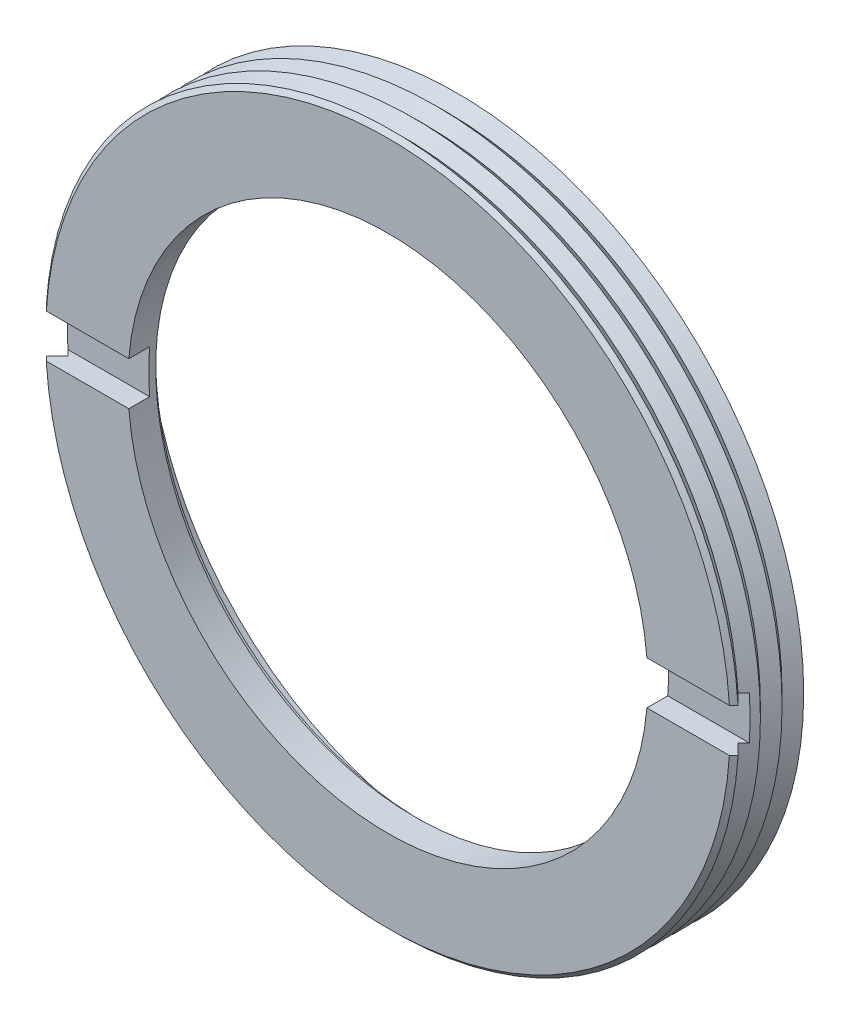
ISO-10303-21;
HEADER;
FILE_DESCRIPTION(('STEP AP214'),'2;1');
FILE_NAME('part.step','',(''),(''),'','','');
FILE_SCHEMA(('AUTOMOTIVE_DESIGN { 1 0 10303 214 1 1 1 1 }'));
ENDSEC;
DATA;
#1=APPLICATION_CONTEXT('core data for automotive mechanical design processes');
#2=APPLICATION_PROTOCOL_DEFINITION('international standard','automotive_design',2000,#1);
#3=PRODUCT_CONTEXT('',#1,'mechanical');
#4=PRODUCT('Part','Part','',(#3));
#5=PRODUCT_RELATED_PRODUCT_CATEGORY('part','',(#4));
#6=PRODUCT_DEFINITION_FORMATION('','',#4);
#7=PRODUCT_DEFINITION_CONTEXT('part definition',#1,'design');
#8=PRODUCT_DEFINITION('design','',#6,#7);
#9=PRODUCT_DEFINITION_SHAPE('','',#8);
#10=(LENGTH_UNIT() NAMED_UNIT(*) SI_UNIT(.MILLI.,.METRE.));
#11=(NAMED_UNIT(*) PLANE_ANGLE_UNIT() SI_UNIT($,.RADIAN.));
#12=(NAMED_UNIT(*) SI_UNIT($,.STERADIAN.) SOLID_ANGLE_UNIT());
#13=UNCERTAINTY_MEASURE_WITH_UNIT(LENGTH_MEASURE(1.E-05),#10,'distance_accuracy_value','');
#14=(GEOMETRIC_REPRESENTATION_CONTEXT(3) GLOBAL_UNCERTAINTY_ASSIGNED_CONTEXT((#13)) GLOBAL_UNIT_ASSIGNED_CONTEXT((#10,
#11,#12)) REPRESENTATION_CONTEXT('',''));
#15=CARTESIAN_POINT('',(0.,0.,0.));
#16=DIRECTION('',(0.,0.,1.));
#17=DIRECTION('',(1.,0.,0.));
#18=AXIS2_PLACEMENT_3D('',#15,#16,#17);
#19=CARTESIAN_POINT('',(0.,0.,1.778));
#20=DIRECTION('',(0.,0.,1.));
#21=DIRECTION('',(0.,-1.,0.));
#22=AXIS2_PLACEMENT_3D('',#19,#20,#21);
#23=PLANE('',#22);
#24=DIRECTION('',(1.,0.,0.));
#25=VECTOR('',#24,1.);
#26=CARTESIAN_POINT('',(-12.6751710417453,-0.793749999999999,1.778));
#27=LINE('',#26,#25);
#28=CARTESIAN_POINT('',(-12.4842921780732,-0.793749999999999,1.778));
#29=VERTEX_POINT('',#28);
#30=CARTESIAN_POINT('',(-9.49186946483673,-0.793749999999999,1.778));
#31=VERTEX_POINT('',#30);
#32=EDGE_CURVE('E131',#29,#31,#27,.T.);
#33=ORIENTED_EDGE('',*,*,#32,.T.);
#34=CARTESIAN_POINT('',(0.,0.,1.778));
#35=DIRECTION('',(0.,0.,1.));
#36=DIRECTION('',(1.,0.,0.));
#37=AXIS2_PLACEMENT_3D('',#34,#35,#36);
#38=CIRCLE('',#37,9.525);
#39=CARTESIAN_POINT('',(-9.49186946483673,0.793749999999999,1.778));
#40=VERTEX_POINT('',#39);
#41=EDGE_CURVE('E114',#31,#40,#38,.F.);
#42=ORIENTED_EDGE('',*,*,#41,.T.);
#43=DIRECTION('',(1.,0.,0.));
#44=VECTOR('',#43,1.);
#45=CARTESIAN_POINT('',(-12.6751710417454,0.793749999999999,1.778));
#46=LINE('',#45,#44);
#47=CARTESIAN_POINT('',(-12.4842921780732,0.793749999999999,1.778));
#48=VERTEX_POINT('',#47);
#49=EDGE_CURVE('E118',#40,#48,#46,.F.);
#50=ORIENTED_EDGE('',*,*,#49,.T.);
#51=CARTESIAN_POINT('',(0.,0.,1.778));
#52=DIRECTION('',(0.,0.,-1.));
#53=DIRECTION('',(-1.,0.,0.));
#54=AXIS2_PLACEMENT_3D('',#51,#52,#53);
#55=CIRCLE('',#54,12.5095);
#56=EDGE_CURVE('E20',#48,#29,#55,.F.);
#57=ORIENTED_EDGE('',*,*,#56,.T.);
#58=EDGE_LOOP('',(#33,#42,#50,#57));
#59=FACE_BOUND('',#58,.T.);
#60=ADVANCED_FACE('F17',(#59),#23,.T.);
#61=CARTESIAN_POINT('',(0.,0.,1.778));
#62=DIRECTION('',(0.,0.,1.));
#63=DIRECTION('',(0.,-1.,0.));
#64=AXIS2_PLACEMENT_3D('',#61,#62,#63);
#65=PLANE('',#64);
#66=DIRECTION('',(1.,0.,0.));
#67=VECTOR('',#66,1.);
#68=CARTESIAN_POINT('',(9.49186946483673,0.79375,1.778));
#69=LINE('',#68,#67);
#70=CARTESIAN_POINT('',(12.4842921780732,0.79375,1.778));
#71=VERTEX_POINT('',#70);
#72=CARTESIAN_POINT('',(9.49186946483673,0.79375,1.778));
#73=VERTEX_POINT('',#72);
#74=EDGE_CURVE('E133',#71,#73,#69,.F.);
#75=ORIENTED_EDGE('',*,*,#74,.T.);
#76=CARTESIAN_POINT('',(0.,0.,1.778));
#77=DIRECTION('',(0.,0.,1.));
#78=DIRECTION('',(1.,0.,0.));
#79=AXIS2_PLACEMENT_3D('',#76,#77,#78);
#80=CIRCLE('',#79,9.525);
#81=CARTESIAN_POINT('',(9.49186946483673,-0.793750000000005,1.778));
#82=VERTEX_POINT('',#81);
#83=EDGE_CURVE('E585',#73,#82,#80,.F.);
#84=ORIENTED_EDGE('',*,*,#83,.T.);
#85=DIRECTION('',(1.,0.,0.));
#86=VECTOR('',#85,1.);
#87=CARTESIAN_POINT('',(9.49186946483673,-0.793750000000005,1.778));
#88=LINE('',#87,#86);
#89=CARTESIAN_POINT('',(12.4842921780732,-0.793750000000005,1.778));
#90=VERTEX_POINT('',#89);
#91=EDGE_CURVE('E267',#82,#90,#88,.T.);
#92=ORIENTED_EDGE('',*,*,#91,.T.);
#93=CARTESIAN_POINT('',(0.,0.,1.778));
#94=DIRECTION('',(0.,0.,-1.));
#95=DIRECTION('',(-1.,0.,0.));
#96=AXIS2_PLACEMENT_3D('',#93,#94,#95);
#97=CIRCLE('',#96,12.5095);
#98=EDGE_CURVE('E586',#90,#71,#97,.F.);
#99=ORIENTED_EDGE('',*,*,#98,.T.);
#100=EDGE_LOOP('',(#75,#84,#92,#99));
#101=FACE_BOUND('',#100,.T.);
#102=ADVANCED_FACE('F506',(#101),#65,.T.);
#103=CARTESIAN_POINT('',(9.49186946483673,0.79375,1.778));
#104=DIRECTION('',(0.,1.,0.));
#105=DIRECTION('',(0.,0.,1.));
#106=AXIS2_PLACEMENT_3D('',#103,#104,#105);
#107=PLANE('',#106);
#108=DIRECTION('',(1.,0.,0.));
#109=VECTOR('',#108,1.);
#110=CARTESIAN_POINT('',(0.,0.793749999999998,2.54));
#111=LINE('',#110,#109);
#112=CARTESIAN_POINT('',(9.49186946483673,0.793749999999999,2.54));
#113=VERTEX_POINT('',#112);
#114=CARTESIAN_POINT('',(12.5161061237112,0.793749999999999,2.54));
#115=VERTEX_POINT('',#114);
#116=EDGE_CURVE('E170',#113,#115,#111,.T.);
#117=ORIENTED_EDGE('',*,*,#116,.F.);
#118=DIRECTION('',(0.,0.,1.));
#119=VECTOR('',#118,1.);
#120=CARTESIAN_POINT('',(9.49186946483673,0.79375,1.778));
#121=LINE('',#120,#119);
#122=EDGE_CURVE('E135',#73,#113,#121,.T.);
#123=ORIENTED_EDGE('',*,*,#122,.F.);
#124=ORIENTED_EDGE('',*,*,#74,.F.);
#125=CARTESIAN_POINT('',(12.2774934617423,0.79375,1.984375));
#126=CARTESIAN_POINT('',(12.3119605024312,0.79375,1.94997975584091));
#127=CARTESIAN_POINT('',(12.3464272491366,0.79375,1.91558421709469));
#128=CARTESIAN_POINT('',(12.4153601545802,0.79375,1.84679255042803));
#129=CARTESIAN_POINT('',(12.4498263133185,0.79375,1.81239642250758));
#130=CARTESIAN_POINT('',(12.4842921780732,0.79375,1.778));
#131=B_SPLINE_CURVE_WITH_KNOTS('',3,(#125,#126,#127,#128,#129,#130),.UNSPECIFIED.,.F.,.F.,(4,2,
4),(0.,0.146079045132635,0.292158090265093),.UNSPECIFIED.);
#132=CARTESIAN_POINT('',(12.2774934617423,0.79375,1.984375));
#133=VERTEX_POINT('',#132);
#134=EDGE_CURVE('E136',#133,#71,#131,.T.);
#135=ORIENTED_EDGE('',*,*,#134,.F.);
#136=CARTESIAN_POINT('',(12.6751710417454,0.79375,2.38125000000001));
#137=CARTESIAN_POINT('',(12.6088935704485,0.79375,2.31510203699888));
#138=CARTESIAN_POINT('',(12.5426150364666,0.79375,2.24895513883179));
#139=CARTESIAN_POINT('',(12.4100558431322,0.79375,2.11666347216512));
#140=CARTESIAN_POINT('',(12.3437751837798,0.79375,2.05051870366555));
#141=CARTESIAN_POINT('',(12.2774934617423,0.79375,1.984375));
#142=B_SPLINE_CURVE_WITH_KNOTS('',3,(#136,#137,#138,#139,#140,#141),.UNSPECIFIED.,.F.,.F.,(4,2,
4),(0.,0.280916902010621,0.561833804023545),.UNSPECIFIED.);
#143=CARTESIAN_POINT('',(12.6751710417454,0.79375,2.38125000000001));
#144=VERTEX_POINT('',#143);
#145=EDGE_CURVE('E171',#144,#133,#142,.T.);
#146=ORIENTED_EDGE('',*,*,#145,.F.);
#147=CARTESIAN_POINT('',(12.5161061237112,0.79375,2.54));
#148=CARTESIAN_POINT('',(12.5426172738131,0.79375,2.51354199775168));
#149=CARTESIAN_POINT('',(12.5691282587002,0.79375,2.48708382996084));
#150=CARTESIAN_POINT('',(12.6221498980449,0.79375,2.43416716329418));
#151=CARTESIAN_POINT('',(12.6486605525025,0.79375,2.40770866441835));
#152=CARTESIAN_POINT('',(12.6751710417454,0.79375,2.38125000000001));
#153=B_SPLINE_CURVE_WITH_KNOTS('',3,(#147,#148,#149,#150,#151,#152),.UNSPECIFIED.,.F.,.F.,(4,2,
4),(0.,0.112364597017051,0.224729194034046),.UNSPECIFIED.);
#154=EDGE_CURVE('E127',#115,#144,#153,.T.);
#155=ORIENTED_EDGE('',*,*,#154,.F.);
#156=EDGE_LOOP('',(#117,#123,#124,#135,#146,#155));
#157=FACE_BOUND('',#156,.T.);
#158=ADVANCED_FACE('F185',(#157),#107,.F.);
#159=CARTESIAN_POINT('',(0.,0.,2.38125000000001));
#160=DIRECTION('',(0.,0.,-1.));
#161=DIRECTION('',(0.,1.,0.));
#162=AXIS2_PLACEMENT_3D('',#159,#160,#161);
#163=CONICAL_SURFACE('',#162,12.7,0.785398163397462);
#164=CARTESIAN_POINT('',(0.,0.,2.54));
#165=DIRECTION('',(0.,0.,-1.));
#166=DIRECTION('',(0.,1.,0.));
#167=AXIS2_PLACEMENT_3D('',#164,#165,#166);
#168=CIRCLE('',#167,12.54125);
#169=CARTESIAN_POINT('',(-12.5161061237112,0.793749999999999,2.54));
#170=VERTEX_POINT('',#169);
#171=EDGE_CURVE('E167',#115,#170,#168,.F.);
#172=ORIENTED_EDGE('',*,*,#171,.F.);
#173=ORIENTED_EDGE('',*,*,#154,.T.);
#174=CARTESIAN_POINT('',(0.,0.,2.38125000000001));
#175=DIRECTION('',(0.,0.,1.));
#176=DIRECTION('',(1.,0.,0.));
#177=AXIS2_PLACEMENT_3D('',#174,#175,#176);
#178=CIRCLE('',#177,12.7);
#179=CARTESIAN_POINT('',(-12.6751710417454,0.793749999999999,2.38125000000001));
#180=VERTEX_POINT('',#179);
#181=EDGE_CURVE('E179',#180,#144,#178,.F.);
#182=ORIENTED_EDGE('',*,*,#181,.F.);
#183=CARTESIAN_POINT('',(-12.6751710417454,0.793749999999999,2.38125000000001));
#184=CARTESIAN_POINT('',(-12.6486605525025,0.793749999999999,2.40770866441835));
#185=CARTESIAN_POINT('',(-12.6221498980449,0.793749999999999,2.43416716329418));
#186=CARTESIAN_POINT('',(-12.5691282587002,0.793749999999999,2.48708382996084));
#187=CARTESIAN_POINT('',(-12.5426172738131,0.793749999999999,2.51354199775168));
#188=CARTESIAN_POINT('',(-12.5161061237112,0.793749999999999,2.54));
#189=B_SPLINE_CURVE_WITH_KNOTS('',3,(#183,#184,#185,#186,#187,#188),.UNSPECIFIED.,.F.,.F.,(4,2,
4),(0.,0.112364597016995,0.224729194034046),.UNSPECIFIED.);
#190=EDGE_CURVE('E123',#180,#170,#189,.T.);
#191=ORIENTED_EDGE('',*,*,#190,.T.);
#192=EDGE_LOOP('',(#172,#173,#182,#191));
#193=FACE_BOUND('',#192,.T.);
#194=ADVANCED_FACE('F490',(#193),#163,.T.);
#195=CARTESIAN_POINT('',(-12.6751710417454,0.793749999999999,1.778));
#196=DIRECTION('',(0.,1.,0.));
#197=DIRECTION('',(0.,0.,1.));
#198=AXIS2_PLACEMENT_3D('',#195,#196,#197);
#199=PLANE('',#198);
#200=CARTESIAN_POINT('',(-12.2774934617423,0.793749999999999,1.984375));
#201=CARTESIAN_POINT('',(-12.3437751837798,0.793749999999999,2.05051870366555));
#202=CARTESIAN_POINT('',(-12.4100558431322,0.793749999999999,2.11666347216512));
#203=CARTESIAN_POINT('',(-12.5426150364666,0.793749999999999,2.24895513883179));
#204=CARTESIAN_POINT('',(-12.6088935704485,0.793749999999999,2.31510203699888));
#205=CARTESIAN_POINT('',(-12.6751710417454,0.793749999999999,2.38125000000001));
#206=B_SPLINE_CURVE_WITH_KNOTS('',3,(#200,#201,#202,#203,#204,#205),.UNSPECIFIED.,.F.,.F.,(4,2,
4),(0.,0.280916902012924,0.561833804023546),.UNSPECIFIED.);
#207=CARTESIAN_POINT('',(-12.2774934617423,0.793749999999999,1.984375));
#208=VERTEX_POINT('',#207);
#209=EDGE_CURVE('E121',#208,#180,#206,.T.);
#210=ORIENTED_EDGE('',*,*,#209,.F.);
#211=CARTESIAN_POINT('',(-12.4842921780732,0.793749999999999,1.778));
#212=CARTESIAN_POINT('',(-12.4498263133185,0.793749999999999,1.81239642250758));
#213=CARTESIAN_POINT('',(-12.4153601545802,0.793749999999999,1.84679255042803));
#214=CARTESIAN_POINT('',(-12.3464272491366,0.793749999999999,1.91558421709469));
#215=CARTESIAN_POINT('',(-12.3119605024312,0.793749999999999,1.94997975584091));
#216=CARTESIAN_POINT('',(-12.2774934617423,0.793749999999999,1.984375));
#217=B_SPLINE_CURVE_WITH_KNOTS('',3,(#211,#212,#213,#214,#215,#216),.UNSPECIFIED.,.F.,.F.,(4,2,
4),(0.,0.146079045132461,0.292158090265097),.UNSPECIFIED.);
#218=EDGE_CURVE('E110',#48,#208,#217,.T.);
#219=ORIENTED_EDGE('',*,*,#218,.F.);
#220=ORIENTED_EDGE('',*,*,#49,.F.);
#221=DIRECTION('',(0.,0.,1.));
#222=VECTOR('',#221,1.);
#223=CARTESIAN_POINT('',(-9.49186946483673,0.793749999999999,1.778));
#224=LINE('',#223,#222);
#225=CARTESIAN_POINT('',(-9.49186946483673,0.793749999999999,2.54));
#226=VERTEX_POINT('',#225);
#227=EDGE_CURVE('E125',#226,#40,#224,.F.);
#228=ORIENTED_EDGE('',*,*,#227,.F.);
#229=DIRECTION('',(1.,0.,0.));
#230=VECTOR('',#229,1.);
#231=CARTESIAN_POINT('',(0.,0.793749999999998,2.54));
#232=LINE('',#231,#230);
#233=EDGE_CURVE('E169',#170,#226,#232,.T.);
#234=ORIENTED_EDGE('',*,*,#233,.F.);
#235=ORIENTED_EDGE('',*,*,#190,.F.);
#236=EDGE_LOOP('',(#210,#219,#220,#228,#234,#235));
#237=FACE_BOUND('',#236,.T.);
#238=ADVANCED_FACE('F117',(#237),#199,.F.);
#239=CARTESIAN_POINT('',(-12.6751710417453,-0.793749999999999,1.778));
#240=DIRECTION('',(0.,-1.,0.));
#241=DIRECTION('',(0.,0.,-1.));
#242=AXIS2_PLACEMENT_3D('',#239,#240,#241);
#243=PLANE('',#242);
#244=DIRECTION('',(1.,0.,0.));
#245=VECTOR('',#244,1.);
#246=CARTESIAN_POINT('',(0.,-0.793749999999998,2.54));
#247=LINE('',#246,#245);
#248=CARTESIAN_POINT('',(-9.49186946483673,-0.793749999999998,2.54));
#249=VERTEX_POINT('',#248);
#250=CARTESIAN_POINT('',(-12.5161061237112,-0.793749999999998,2.54));
#251=VERTEX_POINT('',#250);
#252=EDGE_CURVE('E166',#249,#251,#247,.F.);
#253=ORIENTED_EDGE('',*,*,#252,.F.);
#254=DIRECTION('',(0.,0.,-1.));
#255=VECTOR('',#254,1.);
#256=CARTESIAN_POINT('',(-9.49186946483673,-0.793749999999999,1.778));
#257=LINE('',#256,#255);
#258=EDGE_CURVE('E35',#31,#249,#257,.F.);
#259=ORIENTED_EDGE('',*,*,#258,.F.);
#260=ORIENTED_EDGE('',*,*,#32,.F.);
#261=CARTESIAN_POINT('',(-12.2774934617423,-0.793749999999999,1.984375));
#262=CARTESIAN_POINT('',(-12.3119605024312,-0.793749999999999,1.94997975584091));
#263=CARTESIAN_POINT('',(-12.3464272491366,-0.793749999999999,1.91558421709469));
#264=CARTESIAN_POINT('',(-12.4153601545802,-0.793749999999999,1.84679255042803));
#265=CARTESIAN_POINT('',(-12.4498263133185,-0.793749999999999,1.81239642250758));
#266=CARTESIAN_POINT('',(-12.4842921780732,-0.793749999999999,1.778));
#267=B_SPLINE_CURVE_WITH_KNOTS('',3,(#261,#262,#263,#264,#265,#266),.UNSPECIFIED.,.F.,.F.,(4,2,
4),(0.,0.146079045132636,0.292158090265096),.UNSPECIFIED.);
#268=CARTESIAN_POINT('',(-12.2774934617423,-0.793749999999999,1.984375));
#269=VERTEX_POINT('',#268);
#270=EDGE_CURVE('E113',#269,#29,#267,.T.);
#271=ORIENTED_EDGE('',*,*,#270,.F.);
#272=CARTESIAN_POINT('',(-12.6751710417454,-0.793749999999999,2.38125000000001));
#273=CARTESIAN_POINT('',(-12.6088935704485,-0.793749999999999,2.31510203699888));
#274=CARTESIAN_POINT('',(-12.5426150364666,-0.793749999999999,2.24895513883179));
#275=CARTESIAN_POINT('',(-12.4100558431322,-0.793749999999999,2.11666347216512));
#276=CARTESIAN_POINT('',(-12.3437751837798,-0.793749999999999,2.05051870366554));
#277=CARTESIAN_POINT('',(-12.2774934617423,-0.793749999999999,1.984375));
#278=B_SPLINE_CURVE_WITH_KNOTS('',3,(#272,#273,#274,#275,#276,#277),.UNSPECIFIED.,.F.,.F.,(4,2,
4),(0.,0.280916902010623,0.561833804023548),.UNSPECIFIED.);
#279=CARTESIAN_POINT('',(-12.6751710417454,-0.793749999999999,2.38125000000001));
#280=VERTEX_POINT('',#279);
#281=EDGE_CURVE('E211',#280,#269,#278,.T.);
#282=ORIENTED_EDGE('',*,*,#281,.F.);
#283=CARTESIAN_POINT('',(-12.5161061237112,-0.793749999999999,2.54));
#284=CARTESIAN_POINT('',(-12.5426172738131,-0.793749999999999,2.51354199775168));
#285=CARTESIAN_POINT('',(-12.5691282587002,-0.793749999999999,2.48708382996084));
#286=CARTESIAN_POINT('',(-12.6221498980449,-0.793749999999999,2.43416716329418));
#287=CARTESIAN_POINT('',(-12.6486605525025,-0.793749999999999,2.40770866441835));
#288=CARTESIAN_POINT('',(-12.6751710417454,-0.793749999999999,2.38125000000001));
#289=B_SPLINE_CURVE_WITH_KNOTS('',3,(#283,#284,#285,#286,#287,#288),.UNSPECIFIED.,.F.,.F.,(4,2,
4),(0.,0.112364597017051,0.224729194034046),.UNSPECIFIED.);
#290=EDGE_CURVE('E234',#251,#280,#289,.T.);
#291=ORIENTED_EDGE('',*,*,#290,.F.);
#292=EDGE_LOOP('',(#253,#259,#260,#271,#282,#291));
#293=FACE_BOUND('',#292,.T.);
#294=ADVANCED_FACE('F224',(#293),#243,.F.);
#295=CARTESIAN_POINT('',(0.,0.,2.38125000000001));
#296=DIRECTION('',(0.,0.,-1.));
#297=DIRECTION('',(0.,1.,0.));
#298=AXIS2_PLACEMENT_3D('',#295,#296,#297);
#299=CONICAL_SURFACE('',#298,12.7,0.785398163397462);
#300=CARTESIAN_POINT('',(0.,0.,2.38125000000001));
#301=DIRECTION('',(0.,0.,1.));
#302=DIRECTION('',(1.,0.,0.));
#303=AXIS2_PLACEMENT_3D('',#300,#301,#302);
#304=CIRCLE('',#303,12.7);
#305=CARTESIAN_POINT('',(12.6751710417454,-0.793750000000005,2.38125000000001));
#306=VERTEX_POINT('',#305);
#307=EDGE_CURVE('E218',#306,#280,#304,.F.);
#308=ORIENTED_EDGE('',*,*,#307,.F.);
#309=CARTESIAN_POINT('',(12.6751710417454,-0.793750000000005,2.38125000000001));
#310=CARTESIAN_POINT('',(12.6486605525025,-0.793750000000005,2.40770866441835));
#311=CARTESIAN_POINT('',(12.6221498980449,-0.793750000000005,2.43416716329418));
#312=CARTESIAN_POINT('',(12.5691282587002,-0.793750000000005,2.48708382996085));
#313=CARTESIAN_POINT('',(12.5426172738131,-0.793750000000005,2.51354199775168));
#314=CARTESIAN_POINT('',(12.5161061237112,-0.793750000000005,2.54));
#315=B_SPLINE_CURVE_WITH_KNOTS('',3,(#309,#310,#311,#312,#313,#314),.UNSPECIFIED.,.F.,.F.,(4,2,
4),(0.,0.112364597016996,0.224729194034046),.UNSPECIFIED.);
#316=CARTESIAN_POINT('',(12.5161061237112,-0.793750000000003,2.54));
#317=VERTEX_POINT('',#316);
#318=EDGE_CURVE('E219',#306,#317,#315,.T.);
#319=ORIENTED_EDGE('',*,*,#318,.T.);
#320=CARTESIAN_POINT('',(0.,0.,2.54));
#321=DIRECTION('',(0.,0.,-1.));
#322=DIRECTION('',(0.,1.,0.));
#323=AXIS2_PLACEMENT_3D('',#320,#321,#322);
#324=CIRCLE('',#323,12.54125);
#325=EDGE_CURVE('E163',#251,#317,#324,.F.);
#326=ORIENTED_EDGE('',*,*,#325,.F.);
#327=ORIENTED_EDGE('',*,*,#290,.T.);
#328=EDGE_LOOP('',(#308,#319,#326,#327));
#329=FACE_BOUND('',#328,.T.);
#330=ADVANCED_FACE('F227',(#329),#299,.T.);
#331=CARTESIAN_POINT('',(9.49186946483673,-0.793750000000005,1.778));
#332=DIRECTION('',(0.,-1.,0.));
#333=DIRECTION('',(0.,0.,-1.));
#334=AXIS2_PLACEMENT_3D('',#331,#332,#333);
#335=PLANE('',#334);
#336=CARTESIAN_POINT('',(12.2774934617423,-0.793750000000005,1.984375));
#337=CARTESIAN_POINT('',(12.3437751837798,-0.793750000000005,2.05051870366555));
#338=CARTESIAN_POINT('',(12.4100558431322,-0.793750000000005,2.11666347216512));
#339=CARTESIAN_POINT('',(12.5426150364666,-0.793750000000005,2.24895513883179));
#340=CARTESIAN_POINT('',(12.6088935704485,-0.793750000000005,2.31510203699888));
#341=CARTESIAN_POINT('',(12.6751710417454,-0.793750000000005,2.38125000000001));
#342=B_SPLINE_CURVE_WITH_KNOTS('',3,(#336,#337,#338,#339,#340,#341),.UNSPECIFIED.,.F.,.F.,(4,2,
4),(0.,0.280916902012924,0.561833804023546),.UNSPECIFIED.);
#343=CARTESIAN_POINT('',(12.2774934617423,-0.793750000000005,1.984375));
#344=VERTEX_POINT('',#343);
#345=EDGE_CURVE('E206',#344,#306,#342,.T.);
#346=ORIENTED_EDGE('',*,*,#345,.F.);
#347=CARTESIAN_POINT('',(12.4842921780732,-0.793750000000005,1.778));
#348=CARTESIAN_POINT('',(12.4498263133185,-0.793750000000005,1.81239642250758));
#349=CARTESIAN_POINT('',(12.4153601545802,-0.793750000000005,1.84679255042803));
#350=CARTESIAN_POINT('',(12.3464272491366,-0.793750000000005,1.91558421709469));
#351=CARTESIAN_POINT('',(12.3119605024312,-0.793750000000005,1.94997975584091));
#352=CARTESIAN_POINT('',(12.2774934617423,-0.793750000000005,1.984375));
#353=B_SPLINE_CURVE_WITH_KNOTS('',3,(#347,#348,#349,#350,#351,#352),.UNSPECIFIED.,.F.,.F.,(4,2,
4),(0.,0.14607904513246,0.292158090265096),.UNSPECIFIED.);
#354=EDGE_CURVE('E263',#90,#344,#353,.T.);
#355=ORIENTED_EDGE('',*,*,#354,.F.);
#356=ORIENTED_EDGE('',*,*,#91,.F.);
#357=DIRECTION('',(0.,0.,-1.));
#358=VECTOR('',#357,1.);
#359=CARTESIAN_POINT('',(9.49186946483673,-0.793750000000005,1.778));
#360=LINE('',#359,#358);
#361=CARTESIAN_POINT('',(9.49186946483673,-0.793750000000003,2.54));
#362=VERTEX_POINT('',#361);
#363=EDGE_CURVE('E272',#362,#82,#360,.T.);
#364=ORIENTED_EDGE('',*,*,#363,.F.);
#365=DIRECTION('',(1.,0.,0.));
#366=VECTOR('',#365,1.);
#367=CARTESIAN_POINT('',(0.,-0.79375,2.54));
#368=LINE('',#367,#366);
#369=EDGE_CURVE('E165',#317,#362,#368,.F.);
#370=ORIENTED_EDGE('',*,*,#369,.F.);
#371=ORIENTED_EDGE('',*,*,#318,.F.);
#372=EDGE_LOOP('',(#346,#355,#356,#364,#370,#371));
#373=FACE_BOUND('',#372,.T.);
#374=ADVANCED_FACE('F201',(#373),#335,.F.);
#375=CARTESIAN_POINT('',(0.,0.,2.38125000000001));
#376=DIRECTION('',(0.,0.,1.));
#377=DIRECTION('',(1.,0.,0.));
#378=AXIS2_PLACEMENT_3D('',#375,#376,#377);
#379=CONICAL_SURFACE('',#378,12.7,0.785398163397451);
#380=CARTESIAN_POINT('',(0.,0.,1.984375));
#381=DIRECTION('',(0.,0.,-1.));
#382=DIRECTION('',(-1.,0.,0.));
#383=AXIS2_PLACEMENT_3D('',#380,#381,#382);
#384=CIRCLE('',#383,12.303125);
#385=EDGE_CURVE('E280',#344,#269,#384,.T.);
#386=ORIENTED_EDGE('',*,*,#385,.F.);
#387=ORIENTED_EDGE('',*,*,#345,.T.);
#388=ORIENTED_EDGE('',*,*,#307,.T.);
#389=ORIENTED_EDGE('',*,*,#281,.T.);
#390=EDGE_LOOP('',(#386,#387,#388,#389));
#391=FACE_BOUND('',#390,.T.);
#392=ADVANCED_FACE('F194',(#391),#379,.T.);
#393=CARTESIAN_POINT('',(0.,0.,2.38125000000001));
#394=DIRECTION('',(0.,0.,1.));
#395=DIRECTION('',(1.,0.,0.));
#396=AXIS2_PLACEMENT_3D('',#393,#394,#395);
#397=CONICAL_SURFACE('',#396,12.7,0.785398163397452);
#398=ORIENTED_EDGE('',*,*,#181,.T.);
#399=ORIENTED_EDGE('',*,*,#145,.T.);
#400=CARTESIAN_POINT('',(0.,0.,1.984375));
#401=DIRECTION('',(0.,0.,-1.));
#402=DIRECTION('',(-1.,0.,0.));
#403=AXIS2_PLACEMENT_3D('',#400,#401,#402);
#404=CIRCLE('',#403,12.303125);
#405=EDGE_CURVE('E162',#208,#133,#404,.T.);
#406=ORIENTED_EDGE('',*,*,#405,.F.);
#407=ORIENTED_EDGE('',*,*,#209,.T.);
#408=EDGE_LOOP('',(#398,#399,#406,#407));
#409=FACE_BOUND('',#408,.T.);
#410=ADVANCED_FACE('F188',(#409),#397,.T.);
#411=CARTESIAN_POINT('',(0.,0.,2.54));
#412=DIRECTION('',(0.,0.,1.));
#413=DIRECTION('',(0.,-1.,0.));
#414=AXIS2_PLACEMENT_3D('',#411,#412,#413);
#415=PLANE('',#414);
#416=ORIENTED_EDGE('',*,*,#171,.T.);
#417=ORIENTED_EDGE('',*,*,#233,.T.);
#418=CARTESIAN_POINT('',(0.,0.,2.54));
#419=DIRECTION('',(0.,0.,1.));
#420=DIRECTION('',(1.,0.,0.));
#421=AXIS2_PLACEMENT_3D('',#418,#419,#420);
#422=CIRCLE('',#421,9.525);
#423=EDGE_CURVE('E159',#226,#113,#422,.F.);
#424=ORIENTED_EDGE('',*,*,#423,.T.);
#425=ORIENTED_EDGE('',*,*,#116,.T.);
#426=EDGE_LOOP('',(#416,#417,#424,#425));
#427=FACE_BOUND('',#426,.T.);
#428=ADVANCED_FACE('F193',(#427),#415,.T.);
#429=CARTESIAN_POINT('',(0.,0.,2.54));
#430=DIRECTION('',(0.,0.,1.));
#431=DIRECTION('',(0.,-1.,0.));
#432=AXIS2_PLACEMENT_3D('',#429,#430,#431);
#433=PLANE('',#432);
#434=ORIENTED_EDGE('',*,*,#325,.T.);
#435=ORIENTED_EDGE('',*,*,#369,.T.);
#436=CARTESIAN_POINT('',(0.,0.,2.54));
#437=DIRECTION('',(0.,0.,1.));
#438=DIRECTION('',(1.,0.,0.));
#439=AXIS2_PLACEMENT_3D('',#436,#437,#438);
#440=CIRCLE('',#439,9.525);
#441=EDGE_CURVE('E156',#362,#249,#440,.F.);
#442=ORIENTED_EDGE('',*,*,#441,.T.);
#443=ORIENTED_EDGE('',*,*,#252,.T.);
#444=EDGE_LOOP('',(#434,#435,#442,#443));
#445=FACE_BOUND('',#444,.T.);
#446=ADVANCED_FACE('F251',(#445),#433,.T.);
#447=CARTESIAN_POINT('',(0.,0.,1.58750000000001));
#448=DIRECTION('',(0.,0.,-1.));
#449=DIRECTION('',(-1.,0.,0.));
#450=AXIS2_PLACEMENT_3D('',#447,#448,#449);
#451=CONICAL_SURFACE('',#450,12.7,0.785398163397464);
#452=CARTESIAN_POINT('',(0.,0.,1.5875));
#453=DIRECTION('',(0.,0.,1.));
#454=DIRECTION('',(1.,0.,0.));
#455=AXIS2_PLACEMENT_3D('',#452,#453,#454);
#456=CIRCLE('',#455,12.7);
#457=CARTESIAN_POINT('',(12.7,0.,1.5875));
#458=VERTEX_POINT('',#457);
#459=EDGE_CURVE('E155',#458,#458,#456,.F.);
#460=ORIENTED_EDGE('',*,*,#459,.F.);
#461=EDGE_LOOP('',(#460));
#462=FACE_BOUND('',#461,.T.);
#463=ORIENTED_EDGE('',*,*,#405,.T.);
#464=ORIENTED_EDGE('',*,*,#134,.T.);
#465=ORIENTED_EDGE('',*,*,#98,.F.);
#466=ORIENTED_EDGE('',*,*,#354,.T.);
#467=ORIENTED_EDGE('',*,*,#385,.T.);
#468=ORIENTED_EDGE('',*,*,#270,.T.);
#469=ORIENTED_EDGE('',*,*,#56,.F.);
#470=ORIENTED_EDGE('',*,*,#218,.T.);
#471=EDGE_LOOP('',(#463,#464,#465,#466,#467,#468,#469,#470));
#472=FACE_BOUND('',#471,.T.);
#473=ADVANCED_FACE('F109',(#462,#472),#451,.T.);
#474=CARTESIAN_POINT('',(0.,0.,0.));
#475=DIRECTION('',(0.,0.,1.));
#476=DIRECTION('',(1.,0.,0.));
#477=AXIS2_PLACEMENT_3D('',#474,#475,#476);
#478=CYLINDRICAL_SURFACE('',#477,9.525);
#479=ORIENTED_EDGE('',*,*,#83,.F.);
#480=ORIENTED_EDGE('',*,*,#122,.T.);
#481=ORIENTED_EDGE('',*,*,#423,.F.);
#482=ORIENTED_EDGE('',*,*,#227,.T.);
#483=ORIENTED_EDGE('',*,*,#41,.F.);
#484=ORIENTED_EDGE('',*,*,#258,.T.);
#485=ORIENTED_EDGE('',*,*,#441,.F.);
#486=ORIENTED_EDGE('',*,*,#363,.T.);
#487=EDGE_LOOP('',(#479,#480,#481,#482,#483,#484,#485,#486));
#488=FACE_BOUND('',#487,.T.);
#489=CARTESIAN_POINT('',(0.,0.,1.524));
#490=DIRECTION('',(0.,0.,1.));
#491=DIRECTION('',(1.,0.,0.));
#492=AXIS2_PLACEMENT_3D('',#489,#490,#491);
#493=CIRCLE('',#492,9.525);
#494=CARTESIAN_POINT('',(9.525,0.,1.524));
#495=VERTEX_POINT('',#494);
#496=EDGE_CURVE('E152',#495,#495,#493,.T.);
#497=ORIENTED_EDGE('',*,*,#496,.F.);
#498=EDGE_LOOP('',(#497));
#499=FACE_BOUND('',#498,.T.);
#500=ADVANCED_FACE('F250',(#488,#499),#478,.F.);
#501=CARTESIAN_POINT('',(0.,0.,1.5875));
#502=DIRECTION('',(0.,0.,1.));
#503=DIRECTION('',(0.,-1.,0.));
#504=AXIS2_PLACEMENT_3D('',#501,#502,#503);
#505=CONICAL_SURFACE('',#504,12.7,0.785398163397451);
#506=ORIENTED_EDGE('',*,*,#459,.T.);
#507=EDGE_LOOP('',(#506));
#508=FACE_BOUND('',#507,.T.);
#509=CARTESIAN_POINT('',(0.,0.,1.190625));
#510=DIRECTION('',(0.,0.,-1.));
#511=DIRECTION('',(0.,1.,0.));
#512=AXIS2_PLACEMENT_3D('',#509,#510,#511);
#513=CIRCLE('',#512,12.303125);
#514=CARTESIAN_POINT('',(0.,12.303125,1.190625));
#515=VERTEX_POINT('',#514);
#516=EDGE_CURVE('E151',#515,#515,#513,.T.);
#517=ORIENTED_EDGE('',*,*,#516,.F.);
#518=EDGE_LOOP('',(#517));
#519=FACE_BOUND('',#518,.T.);
#520=ADVANCED_FACE('F325',(#508,#519),#505,.T.);
#521=CARTESIAN_POINT('',(0.,0.,1.524));
#522=DIRECTION('',(0.,0.,-1.));
#523=DIRECTION('',(0.,1.,0.));
#524=AXIS2_PLACEMENT_3D('',#521,#522,#523);
#525=PLANE('',#524);
#526=CARTESIAN_POINT('',(0.,0.,1.524));
#527=DIRECTION('',(0.,0.,-1.));
#528=DIRECTION('',(-1.,0.,0.));
#529=AXIS2_PLACEMENT_3D('',#526,#527,#528);
#530=CIRCLE('',#529,9.77899999999999);
#531=CARTESIAN_POINT('',(-9.77899999999999,0.,1.524));
#532=VERTEX_POINT('',#531);
#533=EDGE_CURVE('E148',#532,#532,#530,.T.);
#534=ORIENTED_EDGE('',*,*,#533,.T.);
#535=EDGE_LOOP('',(#534));
#536=FACE_BOUND('',#535,.T.);
#537=ORIENTED_EDGE('',*,*,#496,.T.);
#538=EDGE_LOOP('',(#537));
#539=FACE_BOUND('',#538,.T.);
#540=ADVANCED_FACE('F315',(#536,#539),#525,.T.);
#541=CARTESIAN_POINT('',(0.,0.,0.793750000000003));
#542=DIRECTION('',(0.,0.,-1.));
#543=DIRECTION('',(0.,1.,0.));
#544=AXIS2_PLACEMENT_3D('',#541,#542,#543);
#545=CONICAL_SURFACE('',#544,12.7,0.785398163397464);
#546=ORIENTED_EDGE('',*,*,#516,.T.);
#547=EDGE_LOOP('',(#546));
#548=FACE_BOUND('',#547,.T.);
#549=CARTESIAN_POINT('',(0.,0.,0.793750000000003));
#550=DIRECTION('',(0.,0.,1.));
#551=DIRECTION('',(1.,0.,0.));
#552=AXIS2_PLACEMENT_3D('',#549,#550,#551);
#553=CIRCLE('',#552,12.7);
#554=CARTESIAN_POINT('',(12.7,0.,0.793750000000003));
#555=VERTEX_POINT('',#554);
#556=EDGE_CURVE('E147',#555,#555,#553,.F.);
#557=ORIENTED_EDGE('',*,*,#556,.F.);
#558=EDGE_LOOP('',(#557));
#559=FACE_BOUND('',#558,.T.);
#560=ADVANCED_FACE('F313',(#548,#559),#545,.T.);
#561=CARTESIAN_POINT('',(0.,0.,1.524));
#562=DIRECTION('',(0.,0.,-1.));
#563=DIRECTION('',(-1.,0.,0.));
#564=AXIS2_PLACEMENT_3D('',#561,#562,#563);
#565=CYLINDRICAL_SURFACE('',#564,9.77899999999999);
#566=ORIENTED_EDGE('',*,*,#533,.F.);
#567=EDGE_LOOP('',(#566));
#568=FACE_BOUND('',#567,.T.);
#569=CARTESIAN_POINT('',(0.,0.,1.27));
#570=DIRECTION('',(0.,0.,-1.));
#571=DIRECTION('',(-1.,0.,0.));
#572=AXIS2_PLACEMENT_3D('',#569,#570,#571);
#573=CIRCLE('',#572,9.77899999999999);
#574=CARTESIAN_POINT('',(-9.77899999999999,0.,1.27));
#575=VERTEX_POINT('',#574);
#576=EDGE_CURVE('E144',#575,#575,#573,.F.);
#577=ORIENTED_EDGE('',*,*,#576,.F.);
#578=EDGE_LOOP('',(#577));
#579=FACE_BOUND('',#578,.T.);
#580=ADVANCED_FACE('F309',(#568,#579),#565,.F.);
#581=CARTESIAN_POINT('',(0.,0.,0.79375000000001));
#582=DIRECTION('',(0.,0.,1.));
#583=DIRECTION('',(1.,0.,0.));
#584=AXIS2_PLACEMENT_3D('',#581,#582,#583);
#585=CONICAL_SURFACE('',#584,12.7,0.785398163397451);
#586=CARTESIAN_POINT('',(0.,0.,0.396874999999998));
#587=DIRECTION('',(0.,0.,-1.));
#588=DIRECTION('',(-1.,0.,0.));
#589=AXIS2_PLACEMENT_3D('',#586,#587,#588);
#590=CIRCLE('',#589,12.303125);
#591=CARTESIAN_POINT('',(-12.303125,0.,0.396874999999998));
#592=VERTEX_POINT('',#591);
#593=EDGE_CURVE('E143',#592,#592,#590,.T.);
#594=ORIENTED_EDGE('',*,*,#593,.F.);
#595=EDGE_LOOP('',(#594));
#596=FACE_BOUND('',#595,.T.);
#597=ORIENTED_EDGE('',*,*,#556,.T.);
#598=EDGE_LOOP('',(#597));
#599=FACE_BOUND('',#598,.T.);
#600=ADVANCED_FACE('F305',(#596,#599),#585,.T.);
#601=CARTESIAN_POINT('',(0.,0.,1.27));
#602=DIRECTION('',(0.,0.,-1.));
#603=DIRECTION('',(0.,1.,0.));
#604=AXIS2_PLACEMENT_3D('',#601,#602,#603);
#605=PLANE('',#604);
#606=ORIENTED_EDGE('',*,*,#576,.T.);
#607=EDGE_LOOP('',(#606));
#608=FACE_BOUND('',#607,.T.);
#609=CARTESIAN_POINT('',(0.,0.,1.27));
#610=DIRECTION('',(0.,0.,-1.));
#611=DIRECTION('',(-1.,0.,0.));
#612=AXIS2_PLACEMENT_3D('',#609,#610,#611);
#613=CIRCLE('',#612,11.303);
#614=CARTESIAN_POINT('',(-11.303,0.,1.27));
#615=VERTEX_POINT('',#614);
#616=EDGE_CURVE('E140',#615,#615,#613,.T.);
#617=ORIENTED_EDGE('',*,*,#616,.T.);
#618=EDGE_LOOP('',(#617));
#619=FACE_BOUND('',#618,.T.);
#620=ADVANCED_FACE('F308',(#608,#619),#605,.T.);
#621=CARTESIAN_POINT('',(0.,0.,0.));
#622=DIRECTION('',(0.,0.,-1.));
#623=DIRECTION('',(-1.,0.,0.));
#624=AXIS2_PLACEMENT_3D('',#621,#622,#623);
#625=CONICAL_SURFACE('',#624,12.7,0.785398163397464);
#626=ORIENTED_EDGE('',*,*,#593,.T.);
#627=EDGE_LOOP('',(#626));
#628=FACE_BOUND('',#627,.T.);
#629=CARTESIAN_POINT('',(0.,0.,0.));
#630=DIRECTION('',(0.,0.,-1.));
#631=DIRECTION('',(-1.,0.,0.));
#632=AXIS2_PLACEMENT_3D('',#629,#630,#631);
#633=CIRCLE('',#632,12.7);
#634=CARTESIAN_POINT('',(-12.7,0.,0.));
#635=VERTEX_POINT('',#634);
#636=EDGE_CURVE('E26',#635,#635,#633,.F.);
#637=ORIENTED_EDGE('',*,*,#636,.T.);
#638=EDGE_LOOP('',(#637));
#639=FACE_BOUND('',#638,.T.);
#640=ADVANCED_FACE('F302',(#628,#639),#625,.T.);
#641=CARTESIAN_POINT('',(0.,0.,1.27));
#642=DIRECTION('',(0.,0.,-1.));
#643=DIRECTION('',(-1.,0.,0.));
#644=AXIS2_PLACEMENT_3D('',#641,#642,#643);
#645=CYLINDRICAL_SURFACE('',#644,11.303);
#646=ORIENTED_EDGE('',*,*,#616,.F.);
#647=EDGE_LOOP('',(#646));
#648=FACE_BOUND('',#647,.T.);
#649=CARTESIAN_POINT('',(0.,0.,0.));
#650=DIRECTION('',(0.,0.,-1.));
#651=DIRECTION('',(-1.,0.,0.));
#652=AXIS2_PLACEMENT_3D('',#649,#650,#651);
#653=CIRCLE('',#652,11.303);
#654=CARTESIAN_POINT('',(-11.303,0.,0.));
#655=VERTEX_POINT('',#654);
#656=EDGE_CURVE('E11',#655,#655,#653,.T.);
#657=ORIENTED_EDGE('',*,*,#656,.T.);
#658=EDGE_LOOP('',(#657));
#659=FACE_BOUND('',#658,.T.);
#660=ADVANCED_FACE('F330',(#648,#659),#645,.F.);
#661=CARTESIAN_POINT('',(0.,0.,0.));
#662=DIRECTION('',(0.,0.,1.));
#663=DIRECTION('',(0.,-1.,0.));
#664=AXIS2_PLACEMENT_3D('',#661,#662,#663);
#665=PLANE('',#664);
#666=ORIENTED_EDGE('',*,*,#656,.F.);
#667=EDGE_LOOP('',(#666));
#668=FACE_BOUND('',#667,.T.);
#669=ORIENTED_EDGE('',*,*,#636,.F.);
#670=EDGE_LOOP('',(#669));
#671=FACE_BOUND('',#670,.T.);
#672=ADVANCED_FACE('F328',(#668,#671),#665,.F.);
#673=CLOSED_SHELL('',(#60,#102,#158,#194,#238,#294,#330,#374,#392,#410,#428,#446,#473,#500,#520,
#540,#560,#580,#600,#620,#640,#660,#672));
#674=MANIFOLD_SOLID_BREP('B1',#673);
#675=ADVANCED_BREP_SHAPE_REPRESENTATION('',(#18,#674),#14);
#676=SHAPE_DEFINITION_REPRESENTATION(#9,#675);
ENDSEC;
END-ISO-10303-21;
